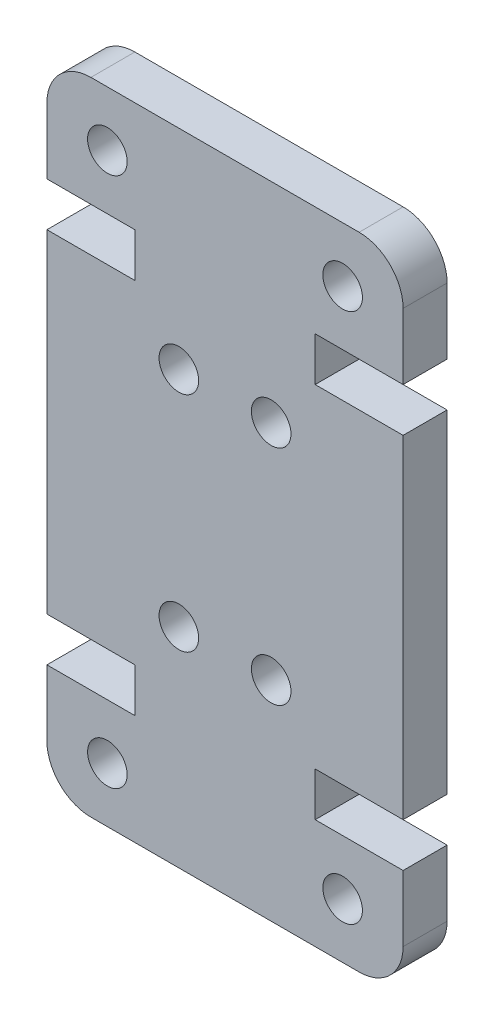
ISO-10303-21;
HEADER;
FILE_DESCRIPTION(('STEP AP214'),'2;1');
FILE_NAME('part.step','',(''),(''),'','','');
FILE_SCHEMA(('AUTOMOTIVE_DESIGN { 1 0 10303 214 1 1 1 1 }'));
ENDSEC;
DATA;
#1=APPLICATION_CONTEXT('core data for automotive mechanical design processes');
#2=APPLICATION_PROTOCOL_DEFINITION('international standard','automotive_design',2000,#1);
#3=PRODUCT_CONTEXT('',#1,'mechanical');
#4=PRODUCT('Part','Part','',(#3));
#5=PRODUCT_RELATED_PRODUCT_CATEGORY('part','',(#4));
#6=PRODUCT_DEFINITION_FORMATION('','',#4);
#7=PRODUCT_DEFINITION_CONTEXT('part definition',#1,'design');
#8=PRODUCT_DEFINITION('design','',#6,#7);
#9=PRODUCT_DEFINITION_SHAPE('','',#8);
#10=(LENGTH_UNIT() NAMED_UNIT(*) SI_UNIT(.MILLI.,.METRE.));
#11=(NAMED_UNIT(*) PLANE_ANGLE_UNIT() SI_UNIT($,.RADIAN.));
#12=(NAMED_UNIT(*) SI_UNIT($,.STERADIAN.) SOLID_ANGLE_UNIT());
#13=UNCERTAINTY_MEASURE_WITH_UNIT(LENGTH_MEASURE(1.E-05),#10,'distance_accuracy_value','');
#14=(GEOMETRIC_REPRESENTATION_CONTEXT(3) GLOBAL_UNCERTAINTY_ASSIGNED_CONTEXT((#13)) GLOBAL_UNIT_ASSIGNED_CONTEXT((#10,
#11,#12)) REPRESENTATION_CONTEXT('',''));
#15=CARTESIAN_POINT('',(0.,0.,0.));
#16=DIRECTION('',(0.,0.,1.));
#17=DIRECTION('',(1.,0.,0.));
#18=AXIS2_PLACEMENT_3D('',#15,#16,#17);
#19=CARTESIAN_POINT('',(2.00000000000002,2.,2.));
#20=DIRECTION('',(0.,0.,1.));
#21=DIRECTION('',(1.,0.,0.));
#22=AXIS2_PLACEMENT_3D('',#19,#20,#21);
#23=PLANE('',#22);
#24=CARTESIAN_POINT('',(10.2,19.6400000000004,2.));
#25=DIRECTION('',(0.,0.,1.));
#26=DIRECTION('',(1.,0.,0.));
#27=AXIS2_PLACEMENT_3D('',#24,#25,#26);
#28=CIRCLE('',#27,0.900000000000001);
#29=CARTESIAN_POINT('',(11.1,19.6400000000004,2.));
#30=VERTEX_POINT('',#29);
#31=EDGE_CURVE('E464',#30,#30,#28,.T.);
#32=ORIENTED_EDGE('',*,*,#31,.F.);
#33=EDGE_LOOP('',(#32));
#34=FACE_BOUND('',#33,.T.);
#35=CARTESIAN_POINT('',(6.,19.6400000000004,2.));
#36=DIRECTION('',(0.,0.,1.));
#37=DIRECTION('',(-1.,0.,0.));
#38=AXIS2_PLACEMENT_3D('',#35,#36,#37);
#39=CIRCLE('',#38,0.9);
#40=CARTESIAN_POINT('',(5.1,19.6400000000004,2.));
#41=VERTEX_POINT('',#40);
#42=EDGE_CURVE('E476',#41,#41,#39,.T.);
#43=ORIENTED_EDGE('',*,*,#42,.F.);
#44=EDGE_LOOP('',(#43));
#45=FACE_BOUND('',#44,.T.);
#46=CARTESIAN_POINT('',(2.75000000000004,26.6399999999998,2.));
#47=DIRECTION('',(0.,0.,1.));
#48=DIRECTION('',(-1.,0.,0.));
#49=AXIS2_PLACEMENT_3D('',#46,#47,#48);
#50=CIRCLE('',#49,0.9);
#51=CARTESIAN_POINT('',(1.85000000000004,26.6399999999998,2.));
#52=VERTEX_POINT('',#51);
#53=EDGE_CURVE('E488',#52,#52,#50,.T.);
#54=ORIENTED_EDGE('',*,*,#53,.F.);
#55=EDGE_LOOP('',(#54));
#56=FACE_BOUND('',#55,.T.);
#57=CARTESIAN_POINT('',(13.45,2.50000000000017,2.));
#58=DIRECTION('',(0.,0.,1.));
#59=DIRECTION('',(-1.,0.,0.));
#60=AXIS2_PLACEMENT_3D('',#57,#58,#59);
#61=CIRCLE('',#60,0.9);
#62=CARTESIAN_POINT('',(12.55,2.50000000000017,2.));
#63=VERTEX_POINT('',#62);
#64=EDGE_CURVE('E230',#63,#63,#61,.T.);
#65=ORIENTED_EDGE('',*,*,#64,.F.);
#66=EDGE_LOOP('',(#65));
#67=FACE_BOUND('',#66,.T.);
#68=DIRECTION('',(1.,0.,0.));
#69=VECTOR('',#68,1.);
#70=CARTESIAN_POINT('',(0.,6.99999999999946,2.));
#71=LINE('',#70,#69);
#72=CARTESIAN_POINT('',(0.,6.99999999999946,2.));
#73=VERTEX_POINT('',#72);
#74=CARTESIAN_POINT('',(4.00000000000002,6.99999999999946,2.));
#75=VERTEX_POINT('',#74);
#76=EDGE_CURVE('E273',#73,#75,#71,.T.);
#77=ORIENTED_EDGE('',*,*,#76,.T.);
#78=DIRECTION('',(0.,-1.,0.));
#79=VECTOR('',#78,1.);
#80=CARTESIAN_POINT('',(4.00000000000002,6.99999999999946,2.));
#81=LINE('',#80,#79);
#82=CARTESIAN_POINT('',(4.,4.99999999999945,2.));
#83=VERTEX_POINT('',#82);
#84=EDGE_CURVE('E141',#75,#83,#81,.T.);
#85=ORIENTED_EDGE('',*,*,#84,.T.);
#86=DIRECTION('',(-1.,0.,0.));
#87=VECTOR('',#86,1.);
#88=CARTESIAN_POINT('',(4.,4.99999999999945,2.));
#89=LINE('',#88,#87);
#90=CARTESIAN_POINT('',(0.,4.99999999999945,2.));
#91=VERTEX_POINT('',#90);
#92=EDGE_CURVE('E336',#83,#91,#89,.T.);
#93=ORIENTED_EDGE('',*,*,#92,.T.);
#94=DIRECTION('',(0.,-1.,0.));
#95=VECTOR('',#94,1.);
#96=CARTESIAN_POINT('',(0.,2.,2.));
#97=LINE('',#96,#95);
#98=CARTESIAN_POINT('',(0.,2.,2.));
#99=VERTEX_POINT('',#98);
#100=EDGE_CURVE('E355',#91,#99,#97,.T.);
#101=ORIENTED_EDGE('',*,*,#100,.T.);
#102=CARTESIAN_POINT('',(2.00000000000002,2.,2.));
#103=DIRECTION('',(0.,0.,1.));
#104=DIRECTION('',(1.,0.,0.));
#105=AXIS2_PLACEMENT_3D('',#102,#103,#104);
#106=CIRCLE('',#105,2.00000000000001);
#107=CARTESIAN_POINT('',(2.00000000000002,0.,2.));
#108=VERTEX_POINT('',#107);
#109=EDGE_CURVE('E352',#99,#108,#106,.T.);
#110=ORIENTED_EDGE('',*,*,#109,.T.);
#111=DIRECTION('',(1.,0.,0.));
#112=VECTOR('',#111,1.);
#113=CARTESIAN_POINT('',(2.00000000000002,0.,2.));
#114=LINE('',#113,#112);
#115=CARTESIAN_POINT('',(14.2,0.,2.));
#116=VERTEX_POINT('',#115);
#117=EDGE_CURVE('E354',#108,#116,#114,.T.);
#118=ORIENTED_EDGE('',*,*,#117,.T.);
#119=CARTESIAN_POINT('',(14.2,2.,2.));
#120=DIRECTION('',(0.,0.,1.));
#121=DIRECTION('',(-1.,0.,0.));
#122=AXIS2_PLACEMENT_3D('',#119,#120,#121);
#123=CIRCLE('',#122,2.);
#124=CARTESIAN_POINT('',(16.2,2.,2.));
#125=VERTEX_POINT('',#124);
#126=EDGE_CURVE('E357',#116,#125,#123,.T.);
#127=ORIENTED_EDGE('',*,*,#126,.T.);
#128=DIRECTION('',(0.,1.,0.));
#129=VECTOR('',#128,1.);
#130=CARTESIAN_POINT('',(16.2,2.,2.));
#131=LINE('',#130,#129);
#132=CARTESIAN_POINT('',(16.2,4.99999999999945,2.));
#133=VERTEX_POINT('',#132);
#134=EDGE_CURVE('E363',#125,#133,#131,.T.);
#135=ORIENTED_EDGE('',*,*,#134,.T.);
#136=DIRECTION('',(-1.,0.,0.));
#137=VECTOR('',#136,1.);
#138=CARTESIAN_POINT('',(12.2,4.99999999999945,2.));
#139=LINE('',#138,#137);
#140=CARTESIAN_POINT('',(12.2,4.99999999999945,2.));
#141=VERTEX_POINT('',#140);
#142=EDGE_CURVE('E365',#133,#141,#139,.T.);
#143=ORIENTED_EDGE('',*,*,#142,.T.);
#144=DIRECTION('',(0.,1.,0.));
#145=VECTOR('',#144,1.);
#146=CARTESIAN_POINT('',(12.2,6.99999999999945,2.));
#147=LINE('',#146,#145);
#148=CARTESIAN_POINT('',(12.2,6.99999999999945,2.));
#149=VERTEX_POINT('',#148);
#150=EDGE_CURVE('E367',#141,#149,#147,.T.);
#151=ORIENTED_EDGE('',*,*,#150,.T.);
#152=DIRECTION('',(1.,0.,0.));
#153=VECTOR('',#152,1.);
#154=CARTESIAN_POINT('',(16.2,6.99999999999945,2.));
#155=LINE('',#154,#153);
#156=CARTESIAN_POINT('',(16.2,6.99999999999945,2.));
#157=VERTEX_POINT('',#156);
#158=EDGE_CURVE('E369',#149,#157,#155,.T.);
#159=ORIENTED_EDGE('',*,*,#158,.T.);
#160=DIRECTION('',(0.,1.,0.));
#161=VECTOR('',#160,1.);
#162=CARTESIAN_POINT('',(16.2,22.1400000000005,2.));
#163=LINE('',#162,#161);
#164=CARTESIAN_POINT('',(16.2,22.1400000000005,2.));
#165=VERTEX_POINT('',#164);
#166=EDGE_CURVE('E371',#157,#165,#163,.T.);
#167=ORIENTED_EDGE('',*,*,#166,.T.);
#168=DIRECTION('',(-1.,0.,0.));
#169=VECTOR('',#168,1.);
#170=CARTESIAN_POINT('',(16.2,22.1400000000005,2.));
#171=LINE('',#170,#169);
#172=CARTESIAN_POINT('',(12.2,22.1400000000005,2.));
#173=VERTEX_POINT('',#172);
#174=EDGE_CURVE('E373',#165,#173,#171,.T.);
#175=ORIENTED_EDGE('',*,*,#174,.T.);
#176=DIRECTION('',(0.,1.,0.));
#177=VECTOR('',#176,1.);
#178=CARTESIAN_POINT('',(12.2,22.1400000000005,2.));
#179=LINE('',#178,#177);
#180=CARTESIAN_POINT('',(12.2,24.1400000000006,2.));
#181=VERTEX_POINT('',#180);
#182=EDGE_CURVE('E375',#173,#181,#179,.T.);
#183=ORIENTED_EDGE('',*,*,#182,.T.);
#184=DIRECTION('',(1.,0.,0.));
#185=VECTOR('',#184,1.);
#186=CARTESIAN_POINT('',(12.2,24.1400000000006,2.));
#187=LINE('',#186,#185);
#188=CARTESIAN_POINT('',(16.2,24.1400000000006,2.));
#189=VERTEX_POINT('',#188);
#190=EDGE_CURVE('E377',#181,#189,#187,.T.);
#191=ORIENTED_EDGE('',*,*,#190,.T.);
#192=DIRECTION('',(0.,1.,0.));
#193=VECTOR('',#192,1.);
#194=CARTESIAN_POINT('',(16.2,27.14,2.));
#195=LINE('',#194,#193);
#196=CARTESIAN_POINT('',(16.2,27.14,2.));
#197=VERTEX_POINT('',#196);
#198=EDGE_CURVE('E379',#189,#197,#195,.T.);
#199=ORIENTED_EDGE('',*,*,#198,.T.);
#200=CARTESIAN_POINT('',(14.2,27.14,2.));
#201=DIRECTION('',(0.,0.,1.));
#202=DIRECTION('',(1.,0.,0.));
#203=AXIS2_PLACEMENT_3D('',#200,#201,#202);
#204=CIRCLE('',#203,2.);
#205=CARTESIAN_POINT('',(14.2,29.14,2.));
#206=VERTEX_POINT('',#205);
#207=EDGE_CURVE('E381',#197,#206,#204,.T.);
#208=ORIENTED_EDGE('',*,*,#207,.T.);
#209=DIRECTION('',(-1.,0.,0.));
#210=VECTOR('',#209,1.);
#211=CARTESIAN_POINT('',(1.99999999999999,29.14,2.));
#212=LINE('',#211,#210);
#213=CARTESIAN_POINT('',(1.99999999999999,29.14,2.));
#214=VERTEX_POINT('',#213);
#215=EDGE_CURVE('E383',#206,#214,#212,.T.);
#216=ORIENTED_EDGE('',*,*,#215,.T.);
#217=CARTESIAN_POINT('',(2.,27.14,2.));
#218=DIRECTION('',(0.,0.,1.));
#219=DIRECTION('',(-1.,0.,0.));
#220=AXIS2_PLACEMENT_3D('',#217,#218,#219);
#221=CIRCLE('',#220,2.);
#222=CARTESIAN_POINT('',(0.,27.14,2.));
#223=VERTEX_POINT('',#222);
#224=EDGE_CURVE('E385',#214,#223,#221,.T.);
#225=ORIENTED_EDGE('',*,*,#224,.T.);
#226=DIRECTION('',(0.,-1.,0.));
#227=VECTOR('',#226,1.);
#228=CARTESIAN_POINT('',(0.,27.14,2.));
#229=LINE('',#228,#227);
#230=CARTESIAN_POINT('',(0.,24.1400000000005,2.));
#231=VERTEX_POINT('',#230);
#232=EDGE_CURVE('E387',#223,#231,#229,.T.);
#233=ORIENTED_EDGE('',*,*,#232,.T.);
#234=DIRECTION('',(1.,0.,0.));
#235=VECTOR('',#234,1.);
#236=CARTESIAN_POINT('',(3.99999999999999,24.1400000000006,2.));
#237=LINE('',#236,#235);
#238=CARTESIAN_POINT('',(3.99999999999999,24.1400000000006,2.));
#239=VERTEX_POINT('',#238);
#240=EDGE_CURVE('E208',#231,#239,#237,.T.);
#241=ORIENTED_EDGE('',*,*,#240,.T.);
#242=DIRECTION('',(0.,-1.,0.));
#243=VECTOR('',#242,1.);
#244=CARTESIAN_POINT('',(4.,22.1400000000005,2.));
#245=LINE('',#244,#243);
#246=CARTESIAN_POINT('',(4.,22.1400000000005,2.));
#247=VERTEX_POINT('',#246);
#248=EDGE_CURVE('E202',#239,#247,#245,.T.);
#249=ORIENTED_EDGE('',*,*,#248,.T.);
#250=DIRECTION('',(-1.,0.,0.));
#251=VECTOR('',#250,1.);
#252=CARTESIAN_POINT('',(0.,22.1400000000005,2.));
#253=LINE('',#252,#251);
#254=CARTESIAN_POINT('',(0.,22.1400000000005,2.));
#255=VERTEX_POINT('',#254);
#256=EDGE_CURVE('E206',#247,#255,#253,.T.);
#257=ORIENTED_EDGE('',*,*,#256,.T.);
#258=DIRECTION('',(0.,-1.,0.));
#259=VECTOR('',#258,1.);
#260=CARTESIAN_POINT('',(0.,22.1400000000005,2.));
#261=LINE('',#260,#259);
#262=EDGE_CURVE('E50',#255,#73,#261,.T.);
#263=ORIENTED_EDGE('',*,*,#262,.T.);
#264=EDGE_LOOP('',(#77,#85,#93,#101,#110,#118,#127,#135,#143,#151,#159,#167,#175,#183,#191,#199,
#208,#216,#225,#233,#241,#249,#257,#263));
#265=FACE_BOUND('',#264,.T.);
#266=CARTESIAN_POINT('',(10.2,9.49999999999962,2.));
#267=DIRECTION('',(0.,0.,1.));
#268=DIRECTION('',(-1.,0.,0.));
#269=AXIS2_PLACEMENT_3D('',#266,#267,#268);
#270=CIRCLE('',#269,0.9);
#271=CARTESIAN_POINT('',(9.29999999999999,9.49999999999962,2.));
#272=VERTEX_POINT('',#271);
#273=EDGE_CURVE('E494',#272,#272,#270,.T.);
#274=ORIENTED_EDGE('',*,*,#273,.F.);
#275=EDGE_LOOP('',(#274));
#276=FACE_BOUND('',#275,.T.);
#277=CARTESIAN_POINT('',(6.00000000000001,9.49999999999962,2.));
#278=DIRECTION('',(0.,0.,1.));
#279=DIRECTION('',(1.,0.,0.));
#280=AXIS2_PLACEMENT_3D('',#277,#278,#279);
#281=CIRCLE('',#280,0.899999999999999);
#282=CARTESIAN_POINT('',(6.9,9.49999999999962,2.));
#283=VERTEX_POINT('',#282);
#284=EDGE_CURVE('E482',#283,#283,#281,.T.);
#285=ORIENTED_EDGE('',*,*,#284,.F.);
#286=EDGE_LOOP('',(#285));
#287=FACE_BOUND('',#286,.T.);
#288=CARTESIAN_POINT('',(2.75000000000004,2.50000000000017,2.));
#289=DIRECTION('',(0.,0.,1.));
#290=DIRECTION('',(1.,0.,0.));
#291=AXIS2_PLACEMENT_3D('',#288,#289,#290);
#292=CIRCLE('',#291,0.9);
#293=CARTESIAN_POINT('',(3.65000000000004,2.50000000000017,2.));
#294=VERTEX_POINT('',#293);
#295=EDGE_CURVE('E470',#294,#294,#292,.T.);
#296=ORIENTED_EDGE('',*,*,#295,.F.);
#297=EDGE_LOOP('',(#296));
#298=FACE_BOUND('',#297,.T.);
#299=CARTESIAN_POINT('',(13.45,26.6399999999998,2.));
#300=DIRECTION('',(0.,0.,1.));
#301=DIRECTION('',(1.,0.,0.));
#302=AXIS2_PLACEMENT_3D('',#299,#300,#301);
#303=CIRCLE('',#302,0.900000000000001);
#304=CARTESIAN_POINT('',(14.35,26.6399999999998,2.));
#305=VERTEX_POINT('',#304);
#306=EDGE_CURVE('E455',#305,#305,#303,.T.);
#307=ORIENTED_EDGE('',*,*,#306,.F.);
#308=EDGE_LOOP('',(#307));
#309=FACE_BOUND('',#308,.T.);
#310=ADVANCED_FACE('F33',(#34,#45,#56,#67,#265,#276,#287,#298,#309),#23,.T.);
#311=CARTESIAN_POINT('',(2.00000000000002,2.,0.));
#312=DIRECTION('',(0.,0.,1.));
#313=DIRECTION('',(1.,0.,0.));
#314=AXIS2_PLACEMENT_3D('',#311,#312,#313);
#315=PLANE('',#314);
#316=CARTESIAN_POINT('',(10.2,19.6400000000004,0.));
#317=DIRECTION('',(0.,0.,1.));
#318=DIRECTION('',(1.,0.,0.));
#319=AXIS2_PLACEMENT_3D('',#316,#317,#318);
#320=CIRCLE('',#319,0.900000000000001);
#321=CARTESIAN_POINT('',(11.1,19.6400000000004,0.));
#322=VERTEX_POINT('',#321);
#323=EDGE_CURVE('E461',#322,#322,#320,.T.);
#324=ORIENTED_EDGE('',*,*,#323,.T.);
#325=EDGE_LOOP('',(#324));
#326=FACE_BOUND('',#325,.T.);
#327=CARTESIAN_POINT('',(6.,19.6400000000004,0.));
#328=DIRECTION('',(0.,0.,1.));
#329=DIRECTION('',(-1.,0.,0.));
#330=AXIS2_PLACEMENT_3D('',#327,#328,#329);
#331=CIRCLE('',#330,0.9);
#332=CARTESIAN_POINT('',(5.1,19.6400000000004,0.));
#333=VERTEX_POINT('',#332);
#334=EDGE_CURVE('E473',#333,#333,#331,.T.);
#335=ORIENTED_EDGE('',*,*,#334,.T.);
#336=EDGE_LOOP('',(#335));
#337=FACE_BOUND('',#336,.T.);
#338=CARTESIAN_POINT('',(2.75000000000004,26.6399999999998,0.));
#339=DIRECTION('',(0.,0.,1.));
#340=DIRECTION('',(-1.,0.,0.));
#341=AXIS2_PLACEMENT_3D('',#338,#339,#340);
#342=CIRCLE('',#341,0.9);
#343=CARTESIAN_POINT('',(1.85000000000004,26.6399999999998,0.));
#344=VERTEX_POINT('',#343);
#345=EDGE_CURVE('E485',#344,#344,#342,.T.);
#346=ORIENTED_EDGE('',*,*,#345,.T.);
#347=EDGE_LOOP('',(#346));
#348=FACE_BOUND('',#347,.T.);
#349=CARTESIAN_POINT('',(13.45,2.50000000000017,0.));
#350=DIRECTION('',(0.,0.,1.));
#351=DIRECTION('',(-1.,0.,0.));
#352=AXIS2_PLACEMENT_3D('',#349,#350,#351);
#353=CIRCLE('',#352,0.9);
#354=CARTESIAN_POINT('',(12.55,2.50000000000017,0.));
#355=VERTEX_POINT('',#354);
#356=EDGE_CURVE('E497',#355,#355,#353,.T.);
#357=ORIENTED_EDGE('',*,*,#356,.T.);
#358=EDGE_LOOP('',(#357));
#359=FACE_BOUND('',#358,.T.);
#360=DIRECTION('',(1.,0.,0.));
#361=VECTOR('',#360,1.);
#362=CARTESIAN_POINT('',(0.,6.99999999999946,0.));
#363=LINE('',#362,#361);
#364=CARTESIAN_POINT('',(0.,6.99999999999946,0.));
#365=VERTEX_POINT('',#364);
#366=CARTESIAN_POINT('',(4.00000000000002,6.99999999999946,0.));
#367=VERTEX_POINT('',#366);
#368=EDGE_CURVE('E226',#365,#367,#363,.T.);
#369=ORIENTED_EDGE('',*,*,#368,.F.);
#370=DIRECTION('',(0.,-1.,0.));
#371=VECTOR('',#370,1.);
#372=CARTESIAN_POINT('',(0.,22.1400000000005,0.));
#373=LINE('',#372,#371);
#374=CARTESIAN_POINT('',(0.,22.1400000000005,0.));
#375=VERTEX_POINT('',#374);
#376=EDGE_CURVE('E133',#375,#365,#373,.T.);
#377=ORIENTED_EDGE('',*,*,#376,.F.);
#378=DIRECTION('',(-1.,0.,0.));
#379=VECTOR('',#378,1.);
#380=CARTESIAN_POINT('',(0.,22.1400000000005,0.));
#381=LINE('',#380,#379);
#382=CARTESIAN_POINT('',(4.,22.1400000000005,0.));
#383=VERTEX_POINT('',#382);
#384=EDGE_CURVE('E127',#383,#375,#381,.T.);
#385=ORIENTED_EDGE('',*,*,#384,.F.);
#386=DIRECTION('',(0.,-1.,0.));
#387=VECTOR('',#386,1.);
#388=CARTESIAN_POINT('',(4.,22.1400000000005,0.));
#389=LINE('',#388,#387);
#390=CARTESIAN_POINT('',(3.99999999999999,24.1400000000006,0.));
#391=VERTEX_POINT('',#390);
#392=EDGE_CURVE('E216',#391,#383,#389,.T.);
#393=ORIENTED_EDGE('',*,*,#392,.F.);
#394=DIRECTION('',(1.,0.,0.));
#395=VECTOR('',#394,1.);
#396=CARTESIAN_POINT('',(3.99999999999999,24.1400000000006,0.));
#397=LINE('',#396,#395);
#398=CARTESIAN_POINT('',(0.,24.1400000000005,0.));
#399=VERTEX_POINT('',#398);
#400=EDGE_CURVE('E268',#399,#391,#397,.T.);
#401=ORIENTED_EDGE('',*,*,#400,.F.);
#402=DIRECTION('',(0.,-1.,0.));
#403=VECTOR('',#402,1.);
#404=CARTESIAN_POINT('',(0.,27.14,0.));
#405=LINE('',#404,#403);
#406=CARTESIAN_POINT('',(0.,27.14,0.));
#407=VERTEX_POINT('',#406);
#408=EDGE_CURVE('E266',#407,#399,#405,.T.);
#409=ORIENTED_EDGE('',*,*,#408,.F.);
#410=CARTESIAN_POINT('',(2.,27.14,0.));
#411=DIRECTION('',(0.,0.,1.));
#412=DIRECTION('',(-1.,0.,0.));
#413=AXIS2_PLACEMENT_3D('',#410,#411,#412);
#414=CIRCLE('',#413,2.);
#415=CARTESIAN_POINT('',(1.99999999999999,29.14,0.));
#416=VERTEX_POINT('',#415);
#417=EDGE_CURVE('E264',#416,#407,#414,.T.);
#418=ORIENTED_EDGE('',*,*,#417,.F.);
#419=DIRECTION('',(-1.,0.,0.));
#420=VECTOR('',#419,1.);
#421=CARTESIAN_POINT('',(1.99999999999999,29.14,0.));
#422=LINE('',#421,#420);
#423=CARTESIAN_POINT('',(14.2,29.14,0.));
#424=VERTEX_POINT('',#423);
#425=EDGE_CURVE('E262',#424,#416,#422,.T.);
#426=ORIENTED_EDGE('',*,*,#425,.F.);
#427=CARTESIAN_POINT('',(14.2,27.14,0.));
#428=DIRECTION('',(0.,0.,1.));
#429=DIRECTION('',(1.,0.,0.));
#430=AXIS2_PLACEMENT_3D('',#427,#428,#429);
#431=CIRCLE('',#430,2.);
#432=CARTESIAN_POINT('',(16.2,27.14,0.));
#433=VERTEX_POINT('',#432);
#434=EDGE_CURVE('E260',#433,#424,#431,.T.);
#435=ORIENTED_EDGE('',*,*,#434,.F.);
#436=DIRECTION('',(0.,1.,0.));
#437=VECTOR('',#436,1.);
#438=CARTESIAN_POINT('',(16.2,27.14,0.));
#439=LINE('',#438,#437);
#440=CARTESIAN_POINT('',(16.2,24.1400000000006,0.));
#441=VERTEX_POINT('',#440);
#442=EDGE_CURVE('E258',#441,#433,#439,.T.);
#443=ORIENTED_EDGE('',*,*,#442,.F.);
#444=DIRECTION('',(1.,0.,0.));
#445=VECTOR('',#444,1.);
#446=CARTESIAN_POINT('',(12.2,24.1400000000006,0.));
#447=LINE('',#446,#445);
#448=CARTESIAN_POINT('',(12.2,24.1400000000006,0.));
#449=VERTEX_POINT('',#448);
#450=EDGE_CURVE('E256',#449,#441,#447,.T.);
#451=ORIENTED_EDGE('',*,*,#450,.F.);
#452=DIRECTION('',(0.,1.,0.));
#453=VECTOR('',#452,1.);
#454=CARTESIAN_POINT('',(12.2,22.1400000000005,0.));
#455=LINE('',#454,#453);
#456=CARTESIAN_POINT('',(12.2,22.1400000000005,0.));
#457=VERTEX_POINT('',#456);
#458=EDGE_CURVE('E254',#457,#449,#455,.T.);
#459=ORIENTED_EDGE('',*,*,#458,.F.);
#460=DIRECTION('',(-1.,0.,0.));
#461=VECTOR('',#460,1.);
#462=CARTESIAN_POINT('',(16.2,22.1400000000005,0.));
#463=LINE('',#462,#461);
#464=CARTESIAN_POINT('',(16.2,22.1400000000005,0.));
#465=VERTEX_POINT('',#464);
#466=EDGE_CURVE('E252',#465,#457,#463,.T.);
#467=ORIENTED_EDGE('',*,*,#466,.F.);
#468=DIRECTION('',(0.,1.,0.));
#469=VECTOR('',#468,1.);
#470=CARTESIAN_POINT('',(16.2,22.1400000000005,0.));
#471=LINE('',#470,#469);
#472=CARTESIAN_POINT('',(16.2,6.99999999999945,0.));
#473=VERTEX_POINT('',#472);
#474=EDGE_CURVE('E250',#473,#465,#471,.T.);
#475=ORIENTED_EDGE('',*,*,#474,.F.);
#476=DIRECTION('',(1.,0.,0.));
#477=VECTOR('',#476,1.);
#478=CARTESIAN_POINT('',(16.2,6.99999999999945,0.));
#479=LINE('',#478,#477);
#480=CARTESIAN_POINT('',(12.2,6.99999999999945,0.));
#481=VERTEX_POINT('',#480);
#482=EDGE_CURVE('E248',#481,#473,#479,.T.);
#483=ORIENTED_EDGE('',*,*,#482,.F.);
#484=DIRECTION('',(0.,1.,0.));
#485=VECTOR('',#484,1.);
#486=CARTESIAN_POINT('',(12.2,6.99999999999945,0.));
#487=LINE('',#486,#485);
#488=CARTESIAN_POINT('',(12.2,4.99999999999945,0.));
#489=VERTEX_POINT('',#488);
#490=EDGE_CURVE('E246',#489,#481,#487,.T.);
#491=ORIENTED_EDGE('',*,*,#490,.F.);
#492=DIRECTION('',(-1.,0.,0.));
#493=VECTOR('',#492,1.);
#494=CARTESIAN_POINT('',(12.2,4.99999999999945,0.));
#495=LINE('',#494,#493);
#496=CARTESIAN_POINT('',(16.2,4.99999999999945,0.));
#497=VERTEX_POINT('',#496);
#498=EDGE_CURVE('E244',#497,#489,#495,.T.);
#499=ORIENTED_EDGE('',*,*,#498,.F.);
#500=DIRECTION('',(0.,1.,0.));
#501=VECTOR('',#500,1.);
#502=CARTESIAN_POINT('',(16.2,2.,0.));
#503=LINE('',#502,#501);
#504=CARTESIAN_POINT('',(16.2,2.,0.));
#505=VERTEX_POINT('',#504);
#506=EDGE_CURVE('E242',#505,#497,#503,.T.);
#507=ORIENTED_EDGE('',*,*,#506,.F.);
#508=CARTESIAN_POINT('',(14.2,2.,0.));
#509=DIRECTION('',(0.,0.,1.));
#510=DIRECTION('',(-1.,0.,0.));
#511=AXIS2_PLACEMENT_3D('',#508,#509,#510);
#512=CIRCLE('',#511,2.);
#513=CARTESIAN_POINT('',(14.2,0.,0.));
#514=VERTEX_POINT('',#513);
#515=EDGE_CURVE('E240',#514,#505,#512,.T.);
#516=ORIENTED_EDGE('',*,*,#515,.F.);
#517=DIRECTION('',(1.,0.,0.));
#518=VECTOR('',#517,1.);
#519=CARTESIAN_POINT('',(2.00000000000002,0.,0.));
#520=LINE('',#519,#518);
#521=CARTESIAN_POINT('',(2.00000000000002,0.,0.));
#522=VERTEX_POINT('',#521);
#523=EDGE_CURVE('E238',#522,#514,#520,.T.);
#524=ORIENTED_EDGE('',*,*,#523,.F.);
#525=CARTESIAN_POINT('',(2.00000000000002,2.,0.));
#526=DIRECTION('',(0.,0.,1.));
#527=DIRECTION('',(1.,0.,0.));
#528=AXIS2_PLACEMENT_3D('',#525,#526,#527);
#529=CIRCLE('',#528,2.00000000000001);
#530=CARTESIAN_POINT('',(0.,2.,0.));
#531=VERTEX_POINT('',#530);
#532=EDGE_CURVE('E236',#531,#522,#529,.T.);
#533=ORIENTED_EDGE('',*,*,#532,.F.);
#534=DIRECTION('',(0.,-1.,0.));
#535=VECTOR('',#534,1.);
#536=CARTESIAN_POINT('',(0.,2.,0.));
#537=LINE('',#536,#535);
#538=CARTESIAN_POINT('',(0.,4.99999999999945,0.));
#539=VERTEX_POINT('',#538);
#540=EDGE_CURVE('E234',#539,#531,#537,.T.);
#541=ORIENTED_EDGE('',*,*,#540,.F.);
#542=DIRECTION('',(-1.,0.,0.));
#543=VECTOR('',#542,1.);
#544=CARTESIAN_POINT('',(4.,4.99999999999945,0.));
#545=LINE('',#544,#543);
#546=CARTESIAN_POINT('',(4.,4.99999999999945,0.));
#547=VERTEX_POINT('',#546);
#548=EDGE_CURVE('E232',#547,#539,#545,.T.);
#549=ORIENTED_EDGE('',*,*,#548,.F.);
#550=DIRECTION('',(0.,-1.,0.));
#551=VECTOR('',#550,1.);
#552=CARTESIAN_POINT('',(4.00000000000002,6.99999999999946,0.));
#553=LINE('',#552,#551);
#554=EDGE_CURVE('E229',#367,#547,#553,.T.);
#555=ORIENTED_EDGE('',*,*,#554,.F.);
#556=EDGE_LOOP('',(#369,#377,#385,#393,#401,#409,#418,#426,#435,#443,#451,#459,#467,#475,#483,
#491,#499,#507,#516,#524,#533,#541,#549,#555));
#557=FACE_BOUND('',#556,.T.);
#558=CARTESIAN_POINT('',(10.2,9.49999999999962,0.));
#559=DIRECTION('',(0.,0.,1.));
#560=DIRECTION('',(-1.,0.,0.));
#561=AXIS2_PLACEMENT_3D('',#558,#559,#560);
#562=CIRCLE('',#561,0.9);
#563=CARTESIAN_POINT('',(9.29999999999999,9.49999999999962,0.));
#564=VERTEX_POINT('',#563);
#565=EDGE_CURVE('E491',#564,#564,#562,.T.);
#566=ORIENTED_EDGE('',*,*,#565,.T.);
#567=EDGE_LOOP('',(#566));
#568=FACE_BOUND('',#567,.T.);
#569=CARTESIAN_POINT('',(6.00000000000001,9.49999999999962,0.));
#570=DIRECTION('',(0.,0.,1.));
#571=DIRECTION('',(1.,0.,0.));
#572=AXIS2_PLACEMENT_3D('',#569,#570,#571);
#573=CIRCLE('',#572,0.899999999999999);
#574=CARTESIAN_POINT('',(6.9,9.49999999999962,0.));
#575=VERTEX_POINT('',#574);
#576=EDGE_CURVE('E479',#575,#575,#573,.T.);
#577=ORIENTED_EDGE('',*,*,#576,.T.);
#578=EDGE_LOOP('',(#577));
#579=FACE_BOUND('',#578,.T.);
#580=CARTESIAN_POINT('',(2.75000000000004,2.50000000000017,0.));
#581=DIRECTION('',(0.,0.,1.));
#582=DIRECTION('',(1.,0.,0.));
#583=AXIS2_PLACEMENT_3D('',#580,#581,#582);
#584=CIRCLE('',#583,0.9);
#585=CARTESIAN_POINT('',(3.65000000000004,2.50000000000017,0.));
#586=VERTEX_POINT('',#585);
#587=EDGE_CURVE('E467',#586,#586,#584,.T.);
#588=ORIENTED_EDGE('',*,*,#587,.T.);
#589=EDGE_LOOP('',(#588));
#590=FACE_BOUND('',#589,.T.);
#591=CARTESIAN_POINT('',(13.45,26.6399999999998,0.));
#592=DIRECTION('',(0.,0.,1.));
#593=DIRECTION('',(1.,0.,0.));
#594=AXIS2_PLACEMENT_3D('',#591,#592,#593);
#595=CIRCLE('',#594,0.900000000000001);
#596=CARTESIAN_POINT('',(14.35,26.6399999999998,0.));
#597=VERTEX_POINT('',#596);
#598=EDGE_CURVE('E458',#597,#597,#595,.T.);
#599=ORIENTED_EDGE('',*,*,#598,.T.);
#600=EDGE_LOOP('',(#599));
#601=FACE_BOUND('',#600,.T.);
#602=ADVANCED_FACE('F340',(#326,#337,#348,#359,#557,#568,#579,#590,#601),#315,.F.);
#603=CARTESIAN_POINT('',(0.,6.99999999999946,2.));
#604=DIRECTION('',(0.,1.,0.));
#605=DIRECTION('',(0.,0.,1.));
#606=AXIS2_PLACEMENT_3D('',#603,#604,#605);
#607=PLANE('',#606);
#608=ORIENTED_EDGE('',*,*,#368,.T.);
#609=DIRECTION('',(0.,0.,-1.));
#610=VECTOR('',#609,1.);
#611=CARTESIAN_POINT('',(4.00000000000002,6.99999999999946,2.));
#612=LINE('',#611,#610);
#613=EDGE_CURVE('E11',#75,#367,#612,.T.);
#614=ORIENTED_EDGE('',*,*,#613,.F.);
#615=ORIENTED_EDGE('',*,*,#76,.F.);
#616=DIRECTION('',(0.,0.,-1.));
#617=VECTOR('',#616,1.);
#618=CARTESIAN_POINT('',(0.,6.99999999999946,2.));
#619=LINE('',#618,#617);
#620=EDGE_CURVE('E222',#73,#365,#619,.T.);
#621=ORIENTED_EDGE('',*,*,#620,.T.);
#622=EDGE_LOOP('',(#608,#614,#615,#621));
#623=FACE_BOUND('',#622,.T.);
#624=ADVANCED_FACE('F35',(#623),#607,.F.);
#625=CARTESIAN_POINT('',(4.00000000000002,6.99999999999946,2.));
#626=DIRECTION('',(1.,0.,0.));
#627=DIRECTION('',(0.,1.,0.));
#628=AXIS2_PLACEMENT_3D('',#625,#626,#627);
#629=PLANE('',#628);
#630=ORIENTED_EDGE('',*,*,#554,.T.);
#631=DIRECTION('',(0.,0.,-1.));
#632=VECTOR('',#631,1.);
#633=CARTESIAN_POINT('',(4.,4.99999999999945,2.));
#634=LINE('',#633,#632);
#635=EDGE_CURVE('E42',#83,#547,#634,.T.);
#636=ORIENTED_EDGE('',*,*,#635,.F.);
#637=ORIENTED_EDGE('',*,*,#84,.F.);
#638=ORIENTED_EDGE('',*,*,#613,.T.);
#639=EDGE_LOOP('',(#630,#636,#637,#638));
#640=FACE_BOUND('',#639,.T.);
#641=ADVANCED_FACE('F762',(#640),#629,.F.);
#642=CARTESIAN_POINT('',(4.,4.99999999999945,2.));
#643=DIRECTION('',(0.,-1.,0.));
#644=DIRECTION('',(0.,0.,-1.));
#645=AXIS2_PLACEMENT_3D('',#642,#643,#644);
#646=PLANE('',#645);
#647=ORIENTED_EDGE('',*,*,#548,.T.);
#648=DIRECTION('',(0.,0.,-1.));
#649=VECTOR('',#648,1.);
#650=CARTESIAN_POINT('',(0.,4.99999999999945,2.));
#651=LINE('',#650,#649);
#652=EDGE_CURVE('E328',#91,#539,#651,.T.);
#653=ORIENTED_EDGE('',*,*,#652,.F.);
#654=ORIENTED_EDGE('',*,*,#92,.F.);
#655=ORIENTED_EDGE('',*,*,#635,.T.);
#656=EDGE_LOOP('',(#647,#653,#654,#655));
#657=FACE_BOUND('',#656,.T.);
#658=ADVANCED_FACE('F334',(#657),#646,.F.);
#659=CARTESIAN_POINT('',(0.,2.,2.));
#660=DIRECTION('',(1.,0.,0.));
#661=DIRECTION('',(0.,0.,-1.));
#662=AXIS2_PLACEMENT_3D('',#659,#660,#661);
#663=PLANE('',#662);
#664=ORIENTED_EDGE('',*,*,#540,.T.);
#665=DIRECTION('',(0.,0.,-1.));
#666=VECTOR('',#665,1.);
#667=CARTESIAN_POINT('',(0.,2.,2.));
#668=LINE('',#667,#666);
#669=EDGE_CURVE('E325',#99,#531,#668,.T.);
#670=ORIENTED_EDGE('',*,*,#669,.F.);
#671=ORIENTED_EDGE('',*,*,#100,.F.);
#672=ORIENTED_EDGE('',*,*,#652,.T.);
#673=EDGE_LOOP('',(#664,#670,#671,#672));
#674=FACE_BOUND('',#673,.T.);
#675=ADVANCED_FACE('F346',(#674),#663,.F.);
#676=CARTESIAN_POINT('',(2.00000000000002,2.,2.));
#677=DIRECTION('',(0.,0.,-1.));
#678=DIRECTION('',(-1.,0.,0.));
#679=AXIS2_PLACEMENT_3D('',#676,#677,#678);
#680=CYLINDRICAL_SURFACE('',#679,2.00000000000001);
#681=ORIENTED_EDGE('',*,*,#532,.T.);
#682=DIRECTION('',(0.,0.,-1.));
#683=VECTOR('',#682,1.);
#684=CARTESIAN_POINT('',(2.00000000000002,0.,2.));
#685=LINE('',#684,#683);
#686=EDGE_CURVE('E322',#108,#522,#685,.T.);
#687=ORIENTED_EDGE('',*,*,#686,.F.);
#688=ORIENTED_EDGE('',*,*,#109,.F.);
#689=ORIENTED_EDGE('',*,*,#669,.T.);
#690=EDGE_LOOP('',(#681,#687,#688,#689));
#691=FACE_BOUND('',#690,.T.);
#692=ADVANCED_FACE('F350',(#691),#680,.T.);
#693=CARTESIAN_POINT('',(2.00000000000002,0.,2.));
#694=DIRECTION('',(0.,1.,0.));
#695=DIRECTION('',(-1.,0.,0.));
#696=AXIS2_PLACEMENT_3D('',#693,#694,#695);
#697=PLANE('',#696);
#698=ORIENTED_EDGE('',*,*,#523,.T.);
#699=DIRECTION('',(0.,0.,-1.));
#700=VECTOR('',#699,1.);
#701=CARTESIAN_POINT('',(14.2,0.,2.));
#702=LINE('',#701,#700);
#703=EDGE_CURVE('E319',#116,#514,#702,.T.);
#704=ORIENTED_EDGE('',*,*,#703,.F.);
#705=ORIENTED_EDGE('',*,*,#117,.F.);
#706=ORIENTED_EDGE('',*,*,#686,.T.);
#707=EDGE_LOOP('',(#698,#704,#705,#706));
#708=FACE_BOUND('',#707,.T.);
#709=ADVANCED_FACE('F727',(#708),#697,.F.);
#710=CARTESIAN_POINT('',(14.2,2.,2.));
#711=DIRECTION('',(0.,0.,-1.));
#712=DIRECTION('',(-1.,0.,0.));
#713=AXIS2_PLACEMENT_3D('',#710,#711,#712);
#714=CYLINDRICAL_SURFACE('',#713,2.);
#715=ORIENTED_EDGE('',*,*,#515,.T.);
#716=DIRECTION('',(0.,0.,-1.));
#717=VECTOR('',#716,1.);
#718=CARTESIAN_POINT('',(16.2,2.,2.));
#719=LINE('',#718,#717);
#720=EDGE_CURVE('E316',#125,#505,#719,.T.);
#721=ORIENTED_EDGE('',*,*,#720,.F.);
#722=ORIENTED_EDGE('',*,*,#126,.F.);
#723=ORIENTED_EDGE('',*,*,#703,.T.);
#724=EDGE_LOOP('',(#715,#721,#722,#723));
#725=FACE_BOUND('',#724,.T.);
#726=ADVANCED_FACE('F717',(#725),#714,.T.);
#727=CARTESIAN_POINT('',(16.2,2.,2.));
#728=DIRECTION('',(-1.,0.,0.));
#729=DIRECTION('',(0.,0.,1.));
#730=AXIS2_PLACEMENT_3D('',#727,#728,#729);
#731=PLANE('',#730);
#732=ORIENTED_EDGE('',*,*,#506,.T.);
#733=DIRECTION('',(0.,0.,-1.));
#734=VECTOR('',#733,1.);
#735=CARTESIAN_POINT('',(16.2,4.99999999999945,2.));
#736=LINE('',#735,#734);
#737=EDGE_CURVE('E313',#133,#497,#736,.T.);
#738=ORIENTED_EDGE('',*,*,#737,.F.);
#739=ORIENTED_EDGE('',*,*,#134,.F.);
#740=ORIENTED_EDGE('',*,*,#720,.T.);
#741=EDGE_LOOP('',(#732,#738,#739,#740));
#742=FACE_BOUND('',#741,.T.);
#743=ADVANCED_FACE('F707',(#742),#731,.F.);
#744=CARTESIAN_POINT('',(12.2,4.99999999999945,2.));
#745=DIRECTION('',(0.,-1.,0.));
#746=DIRECTION('',(0.,0.,-1.));
#747=AXIS2_PLACEMENT_3D('',#744,#745,#746);
#748=PLANE('',#747);
#749=ORIENTED_EDGE('',*,*,#498,.T.);
#750=DIRECTION('',(0.,0.,-1.));
#751=VECTOR('',#750,1.);
#752=CARTESIAN_POINT('',(12.2,4.99999999999945,2.));
#753=LINE('',#752,#751);
#754=EDGE_CURVE('E310',#141,#489,#753,.T.);
#755=ORIENTED_EDGE('',*,*,#754,.F.);
#756=ORIENTED_EDGE('',*,*,#142,.F.);
#757=ORIENTED_EDGE('',*,*,#737,.T.);
#758=EDGE_LOOP('',(#749,#755,#756,#757));
#759=FACE_BOUND('',#758,.T.);
#760=ADVANCED_FACE('F697',(#759),#748,.F.);
#761=CARTESIAN_POINT('',(12.2,6.99999999999945,2.));
#762=DIRECTION('',(-1.,0.,0.));
#763=DIRECTION('',(0.,0.,1.));
#764=AXIS2_PLACEMENT_3D('',#761,#762,#763);
#765=PLANE('',#764);
#766=ORIENTED_EDGE('',*,*,#490,.T.);
#767=DIRECTION('',(0.,0.,-1.));
#768=VECTOR('',#767,1.);
#769=CARTESIAN_POINT('',(12.2,6.99999999999945,2.));
#770=LINE('',#769,#768);
#771=EDGE_CURVE('E307',#149,#481,#770,.T.);
#772=ORIENTED_EDGE('',*,*,#771,.F.);
#773=ORIENTED_EDGE('',*,*,#150,.F.);
#774=ORIENTED_EDGE('',*,*,#754,.T.);
#775=EDGE_LOOP('',(#766,#772,#773,#774));
#776=FACE_BOUND('',#775,.T.);
#777=ADVANCED_FACE('F687',(#776),#765,.F.);
#778=CARTESIAN_POINT('',(16.2,6.99999999999945,2.));
#779=DIRECTION('',(0.,1.,0.));
#780=DIRECTION('',(-1.,0.,0.));
#781=AXIS2_PLACEMENT_3D('',#778,#779,#780);
#782=PLANE('',#781);
#783=ORIENTED_EDGE('',*,*,#482,.T.);
#784=DIRECTION('',(0.,0.,-1.));
#785=VECTOR('',#784,1.);
#786=CARTESIAN_POINT('',(16.2,6.99999999999945,2.));
#787=LINE('',#786,#785);
#788=EDGE_CURVE('E304',#157,#473,#787,.T.);
#789=ORIENTED_EDGE('',*,*,#788,.F.);
#790=ORIENTED_EDGE('',*,*,#158,.F.);
#791=ORIENTED_EDGE('',*,*,#771,.T.);
#792=EDGE_LOOP('',(#783,#789,#790,#791));
#793=FACE_BOUND('',#792,.T.);
#794=ADVANCED_FACE('F677',(#793),#782,.F.);
#795=CARTESIAN_POINT('',(16.2,22.1400000000005,2.));
#796=DIRECTION('',(-1.,0.,0.));
#797=DIRECTION('',(0.,0.,1.));
#798=AXIS2_PLACEMENT_3D('',#795,#796,#797);
#799=PLANE('',#798);
#800=ORIENTED_EDGE('',*,*,#474,.T.);
#801=DIRECTION('',(0.,0.,-1.));
#802=VECTOR('',#801,1.);
#803=CARTESIAN_POINT('',(16.2,22.1400000000005,2.));
#804=LINE('',#803,#802);
#805=EDGE_CURVE('E301',#165,#465,#804,.T.);
#806=ORIENTED_EDGE('',*,*,#805,.F.);
#807=ORIENTED_EDGE('',*,*,#166,.F.);
#808=ORIENTED_EDGE('',*,*,#788,.T.);
#809=EDGE_LOOP('',(#800,#806,#807,#808));
#810=FACE_BOUND('',#809,.T.);
#811=ADVANCED_FACE('F667',(#810),#799,.F.);
#812=CARTESIAN_POINT('',(16.2,22.1400000000005,2.));
#813=DIRECTION('',(0.,-1.,0.));
#814=DIRECTION('',(0.,0.,-1.));
#815=AXIS2_PLACEMENT_3D('',#812,#813,#814);
#816=PLANE('',#815);
#817=ORIENTED_EDGE('',*,*,#466,.T.);
#818=DIRECTION('',(0.,0.,-1.));
#819=VECTOR('',#818,1.);
#820=CARTESIAN_POINT('',(12.2,22.1400000000005,2.));
#821=LINE('',#820,#819);
#822=EDGE_CURVE('E298',#173,#457,#821,.T.);
#823=ORIENTED_EDGE('',*,*,#822,.F.);
#824=ORIENTED_EDGE('',*,*,#174,.F.);
#825=ORIENTED_EDGE('',*,*,#805,.T.);
#826=EDGE_LOOP('',(#817,#823,#824,#825));
#827=FACE_BOUND('',#826,.T.);
#828=ADVANCED_FACE('F657',(#827),#816,.F.);
#829=CARTESIAN_POINT('',(12.2,22.1400000000005,2.));
#830=DIRECTION('',(-1.,0.,0.));
#831=DIRECTION('',(0.,0.,1.));
#832=AXIS2_PLACEMENT_3D('',#829,#830,#831);
#833=PLANE('',#832);
#834=ORIENTED_EDGE('',*,*,#458,.T.);
#835=DIRECTION('',(0.,0.,-1.));
#836=VECTOR('',#835,1.);
#837=CARTESIAN_POINT('',(12.2,24.1400000000006,2.));
#838=LINE('',#837,#836);
#839=EDGE_CURVE('E295',#181,#449,#838,.T.);
#840=ORIENTED_EDGE('',*,*,#839,.F.);
#841=ORIENTED_EDGE('',*,*,#182,.F.);
#842=ORIENTED_EDGE('',*,*,#822,.T.);
#843=EDGE_LOOP('',(#834,#840,#841,#842));
#844=FACE_BOUND('',#843,.T.);
#845=ADVANCED_FACE('F647',(#844),#833,.F.);
#846=CARTESIAN_POINT('',(12.2,24.1400000000006,2.));
#847=DIRECTION('',(0.,1.,0.));
#848=DIRECTION('',(0.,0.,1.));
#849=AXIS2_PLACEMENT_3D('',#846,#847,#848);
#850=PLANE('',#849);
#851=ORIENTED_EDGE('',*,*,#450,.T.);
#852=DIRECTION('',(0.,0.,-1.));
#853=VECTOR('',#852,1.);
#854=CARTESIAN_POINT('',(16.2,24.1400000000006,2.));
#855=LINE('',#854,#853);
#856=EDGE_CURVE('E292',#189,#441,#855,.T.);
#857=ORIENTED_EDGE('',*,*,#856,.F.);
#858=ORIENTED_EDGE('',*,*,#190,.F.);
#859=ORIENTED_EDGE('',*,*,#839,.T.);
#860=EDGE_LOOP('',(#851,#857,#858,#859));
#861=FACE_BOUND('',#860,.T.);
#862=ADVANCED_FACE('F637',(#861),#850,.F.);
#863=CARTESIAN_POINT('',(16.2,27.14,2.));
#864=DIRECTION('',(-1.,0.,0.));
#865=DIRECTION('',(0.,0.,1.));
#866=AXIS2_PLACEMENT_3D('',#863,#864,#865);
#867=PLANE('',#866);
#868=ORIENTED_EDGE('',*,*,#442,.T.);
#869=DIRECTION('',(0.,0.,-1.));
#870=VECTOR('',#869,1.);
#871=CARTESIAN_POINT('',(16.2,27.14,2.));
#872=LINE('',#871,#870);
#873=EDGE_CURVE('E289',#197,#433,#872,.T.);
#874=ORIENTED_EDGE('',*,*,#873,.F.);
#875=ORIENTED_EDGE('',*,*,#198,.F.);
#876=ORIENTED_EDGE('',*,*,#856,.T.);
#877=EDGE_LOOP('',(#868,#874,#875,#876));
#878=FACE_BOUND('',#877,.T.);
#879=ADVANCED_FACE('F627',(#878),#867,.F.);
#880=CARTESIAN_POINT('',(14.2,27.14,2.));
#881=DIRECTION('',(0.,0.,-1.));
#882=DIRECTION('',(-1.,0.,0.));
#883=AXIS2_PLACEMENT_3D('',#880,#881,#882);
#884=CYLINDRICAL_SURFACE('',#883,2.);
#885=ORIENTED_EDGE('',*,*,#434,.T.);
#886=DIRECTION('',(0.,0.,-1.));
#887=VECTOR('',#886,1.);
#888=CARTESIAN_POINT('',(14.2,29.14,2.));
#889=LINE('',#888,#887);
#890=EDGE_CURVE('E286',#206,#424,#889,.T.);
#891=ORIENTED_EDGE('',*,*,#890,.F.);
#892=ORIENTED_EDGE('',*,*,#207,.F.);
#893=ORIENTED_EDGE('',*,*,#873,.T.);
#894=EDGE_LOOP('',(#885,#891,#892,#893));
#895=FACE_BOUND('',#894,.T.);
#896=ADVANCED_FACE('F617',(#895),#884,.T.);
#897=CARTESIAN_POINT('',(1.99999999999999,29.14,2.));
#898=DIRECTION('',(0.,-1.,0.));
#899=DIRECTION('',(0.,0.,-1.));
#900=AXIS2_PLACEMENT_3D('',#897,#898,#899);
#901=PLANE('',#900);
#902=ORIENTED_EDGE('',*,*,#425,.T.);
#903=DIRECTION('',(0.,0.,-1.));
#904=VECTOR('',#903,1.);
#905=CARTESIAN_POINT('',(1.99999999999999,29.14,2.));
#906=LINE('',#905,#904);
#907=EDGE_CURVE('E283',#214,#416,#906,.T.);
#908=ORIENTED_EDGE('',*,*,#907,.F.);
#909=ORIENTED_EDGE('',*,*,#215,.F.);
#910=ORIENTED_EDGE('',*,*,#890,.T.);
#911=EDGE_LOOP('',(#902,#908,#909,#910));
#912=FACE_BOUND('',#911,.T.);
#913=ADVANCED_FACE('F607',(#912),#901,.F.);
#914=CARTESIAN_POINT('',(2.,27.14,2.));
#915=DIRECTION('',(0.,0.,-1.));
#916=DIRECTION('',(-1.,0.,0.));
#917=AXIS2_PLACEMENT_3D('',#914,#915,#916);
#918=CYLINDRICAL_SURFACE('',#917,2.);
#919=ORIENTED_EDGE('',*,*,#417,.T.);
#920=DIRECTION('',(0.,0.,-1.));
#921=VECTOR('',#920,1.);
#922=CARTESIAN_POINT('',(0.,27.14,2.));
#923=LINE('',#922,#921);
#924=EDGE_CURVE('E280',#223,#407,#923,.T.);
#925=ORIENTED_EDGE('',*,*,#924,.F.);
#926=ORIENTED_EDGE('',*,*,#224,.F.);
#927=ORIENTED_EDGE('',*,*,#907,.T.);
#928=EDGE_LOOP('',(#919,#925,#926,#927));
#929=FACE_BOUND('',#928,.T.);
#930=ADVANCED_FACE('F598',(#929),#918,.T.);
#931=CARTESIAN_POINT('',(0.,27.14,2.));
#932=DIRECTION('',(1.,0.,0.));
#933=DIRECTION('',(0.,1.,0.));
#934=AXIS2_PLACEMENT_3D('',#931,#932,#933);
#935=PLANE('',#934);
#936=ORIENTED_EDGE('',*,*,#408,.T.);
#937=DIRECTION('',(0.,0.,-1.));
#938=VECTOR('',#937,1.);
#939=CARTESIAN_POINT('',(0.,24.1400000000005,2.));
#940=LINE('',#939,#938);
#941=EDGE_CURVE('E277',#231,#399,#940,.T.);
#942=ORIENTED_EDGE('',*,*,#941,.F.);
#943=ORIENTED_EDGE('',*,*,#232,.F.);
#944=ORIENTED_EDGE('',*,*,#924,.T.);
#945=EDGE_LOOP('',(#936,#942,#943,#944));
#946=FACE_BOUND('',#945,.T.);
#947=ADVANCED_FACE('F393',(#946),#935,.F.);
#948=CARTESIAN_POINT('',(3.99999999999999,24.1400000000006,2.));
#949=DIRECTION('',(0.,1.,0.));
#950=DIRECTION('',(-1.,0.,0.));
#951=AXIS2_PLACEMENT_3D('',#948,#949,#950);
#952=PLANE('',#951);
#953=ORIENTED_EDGE('',*,*,#400,.T.);
#954=DIRECTION('',(0.,0.,-1.));
#955=VECTOR('',#954,1.);
#956=CARTESIAN_POINT('',(3.99999999999999,24.1400000000006,2.));
#957=LINE('',#956,#955);
#958=EDGE_CURVE('E217',#239,#391,#957,.T.);
#959=ORIENTED_EDGE('',*,*,#958,.F.);
#960=ORIENTED_EDGE('',*,*,#240,.F.);
#961=ORIENTED_EDGE('',*,*,#941,.T.);
#962=EDGE_LOOP('',(#953,#959,#960,#961));
#963=FACE_BOUND('',#962,.T.);
#964=ADVANCED_FACE('F397',(#963),#952,.F.);
#965=CARTESIAN_POINT('',(4.,22.1400000000005,2.));
#966=DIRECTION('',(1.,0.,0.));
#967=DIRECTION('',(0.,1.,0.));
#968=AXIS2_PLACEMENT_3D('',#965,#966,#967);
#969=PLANE('',#968);
#970=ORIENTED_EDGE('',*,*,#392,.T.);
#971=DIRECTION('',(0.,0.,-1.));
#972=VECTOR('',#971,1.);
#973=CARTESIAN_POINT('',(4.,22.1400000000005,2.));
#974=LINE('',#973,#972);
#975=EDGE_CURVE('E213',#247,#383,#974,.T.);
#976=ORIENTED_EDGE('',*,*,#975,.F.);
#977=ORIENTED_EDGE('',*,*,#248,.F.);
#978=ORIENTED_EDGE('',*,*,#958,.T.);
#979=EDGE_LOOP('',(#970,#976,#977,#978));
#980=FACE_BOUND('',#979,.T.);
#981=ADVANCED_FACE('F214',(#980),#969,.F.);
#982=CARTESIAN_POINT('',(0.,22.1400000000005,2.));
#983=DIRECTION('',(0.,-1.,0.));
#984=DIRECTION('',(1.,0.,0.));
#985=AXIS2_PLACEMENT_3D('',#982,#983,#984);
#986=PLANE('',#985);
#987=ORIENTED_EDGE('',*,*,#384,.T.);
#988=DIRECTION('',(0.,0.,-1.));
#989=VECTOR('',#988,1.);
#990=CARTESIAN_POINT('',(0.,22.1400000000005,2.));
#991=LINE('',#990,#989);
#992=EDGE_CURVE('E218',#255,#375,#991,.T.);
#993=ORIENTED_EDGE('',*,*,#992,.F.);
#994=ORIENTED_EDGE('',*,*,#256,.F.);
#995=ORIENTED_EDGE('',*,*,#975,.T.);
#996=EDGE_LOOP('',(#987,#993,#994,#995));
#997=FACE_BOUND('',#996,.T.);
#998=ADVANCED_FACE('F220',(#997),#986,.F.);
#999=CARTESIAN_POINT('',(0.,22.1400000000005,2.));
#1000=DIRECTION('',(1.,0.,0.));
#1001=DIRECTION('',(0.,1.,0.));
#1002=AXIS2_PLACEMENT_3D('',#999,#1000,#1001);
#1003=PLANE('',#1002);
#1004=ORIENTED_EDGE('',*,*,#376,.T.);
#1005=ORIENTED_EDGE('',*,*,#620,.F.);
#1006=ORIENTED_EDGE('',*,*,#262,.F.);
#1007=ORIENTED_EDGE('',*,*,#992,.T.);
#1008=EDGE_LOOP('',(#1004,#1005,#1006,#1007));
#1009=FACE_BOUND('',#1008,.T.);
#1010=ADVANCED_FACE('F401',(#1009),#1003,.F.);
#1011=CARTESIAN_POINT('',(13.45,2.50000000000017,2.));
#1012=DIRECTION('',(0.,0.,-1.));
#1013=DIRECTION('',(-1.,0.,0.));
#1014=AXIS2_PLACEMENT_3D('',#1011,#1012,#1013);
#1015=CYLINDRICAL_SURFACE('',#1014,0.9);
#1016=ORIENTED_EDGE('',*,*,#64,.T.);
#1017=EDGE_LOOP('',(#1016));
#1018=FACE_BOUND('',#1017,.T.);
#1019=ORIENTED_EDGE('',*,*,#356,.F.);
#1020=EDGE_LOOP('',(#1019));
#1021=FACE_BOUND('',#1020,.T.);
#1022=ADVANCED_FACE('F403',(#1018,#1021),#1015,.F.);
#1023=CARTESIAN_POINT('',(10.2,9.49999999999962,2.));
#1024=DIRECTION('',(0.,0.,-1.));
#1025=DIRECTION('',(-1.,0.,0.));
#1026=AXIS2_PLACEMENT_3D('',#1023,#1024,#1025);
#1027=CYLINDRICAL_SURFACE('',#1026,0.9);
#1028=ORIENTED_EDGE('',*,*,#273,.T.);
#1029=EDGE_LOOP('',(#1028));
#1030=FACE_BOUND('',#1029,.T.);
#1031=ORIENTED_EDGE('',*,*,#565,.F.);
#1032=EDGE_LOOP('',(#1031));
#1033=FACE_BOUND('',#1032,.T.);
#1034=ADVANCED_FACE('F409',(#1030,#1033),#1027,.F.);
#1035=CARTESIAN_POINT('',(2.75000000000004,26.6399999999998,2.));
#1036=DIRECTION('',(0.,0.,-1.));
#1037=DIRECTION('',(-1.,0.,0.));
#1038=AXIS2_PLACEMENT_3D('',#1035,#1036,#1037);
#1039=CYLINDRICAL_SURFACE('',#1038,0.9);
#1040=ORIENTED_EDGE('',*,*,#53,.T.);
#1041=EDGE_LOOP('',(#1040));
#1042=FACE_BOUND('',#1041,.T.);
#1043=ORIENTED_EDGE('',*,*,#345,.F.);
#1044=EDGE_LOOP('',(#1043));
#1045=FACE_BOUND('',#1044,.T.);
#1046=ADVANCED_FACE('F426',(#1042,#1045),#1039,.F.);
#1047=CARTESIAN_POINT('',(6.00000000000001,9.49999999999962,2.));
#1048=DIRECTION('',(0.,0.,-1.));
#1049=DIRECTION('',(-1.,0.,0.));
#1050=AXIS2_PLACEMENT_3D('',#1047,#1048,#1049);
#1051=CYLINDRICAL_SURFACE('',#1050,0.899999999999999);
#1052=ORIENTED_EDGE('',*,*,#284,.T.);
#1053=EDGE_LOOP('',(#1052));
#1054=FACE_BOUND('',#1053,.T.);
#1055=ORIENTED_EDGE('',*,*,#576,.F.);
#1056=EDGE_LOOP('',(#1055));
#1057=FACE_BOUND('',#1056,.T.);
#1058=ADVANCED_FACE('F430',(#1054,#1057),#1051,.F.);
#1059=CARTESIAN_POINT('',(6.,19.6400000000004,2.));
#1060=DIRECTION('',(0.,0.,-1.));
#1061=DIRECTION('',(-1.,0.,0.));
#1062=AXIS2_PLACEMENT_3D('',#1059,#1060,#1061);
#1063=CYLINDRICAL_SURFACE('',#1062,0.9);
#1064=ORIENTED_EDGE('',*,*,#42,.T.);
#1065=EDGE_LOOP('',(#1064));
#1066=FACE_BOUND('',#1065,.T.);
#1067=ORIENTED_EDGE('',*,*,#334,.F.);
#1068=EDGE_LOOP('',(#1067));
#1069=FACE_BOUND('',#1068,.T.);
#1070=ADVANCED_FACE('F434',(#1066,#1069),#1063,.F.);
#1071=CARTESIAN_POINT('',(2.75000000000004,2.50000000000017,2.));
#1072=DIRECTION('',(0.,0.,-1.));
#1073=DIRECTION('',(-1.,0.,0.));
#1074=AXIS2_PLACEMENT_3D('',#1071,#1072,#1073);
#1075=CYLINDRICAL_SURFACE('',#1074,0.9);
#1076=ORIENTED_EDGE('',*,*,#295,.T.);
#1077=EDGE_LOOP('',(#1076));
#1078=FACE_BOUND('',#1077,.T.);
#1079=ORIENTED_EDGE('',*,*,#587,.F.);
#1080=EDGE_LOOP('',(#1079));
#1081=FACE_BOUND('',#1080,.T.);
#1082=ADVANCED_FACE('F438',(#1078,#1081),#1075,.F.);
#1083=CARTESIAN_POINT('',(10.2,19.6400000000004,2.));
#1084=DIRECTION('',(0.,0.,-1.));
#1085=DIRECTION('',(-1.,0.,0.));
#1086=AXIS2_PLACEMENT_3D('',#1083,#1084,#1085);
#1087=CYLINDRICAL_SURFACE('',#1086,0.900000000000001);
#1088=ORIENTED_EDGE('',*,*,#31,.T.);
#1089=EDGE_LOOP('',(#1088));
#1090=FACE_BOUND('',#1089,.T.);
#1091=ORIENTED_EDGE('',*,*,#323,.F.);
#1092=EDGE_LOOP('',(#1091));
#1093=FACE_BOUND('',#1092,.T.);
#1094=ADVANCED_FACE('F442',(#1090,#1093),#1087,.F.);
#1095=CARTESIAN_POINT('',(13.45,26.6399999999998,2.));
#1096=DIRECTION('',(0.,0.,-1.));
#1097=DIRECTION('',(-1.,0.,0.));
#1098=AXIS2_PLACEMENT_3D('',#1095,#1096,#1097);
#1099=CYLINDRICAL_SURFACE('',#1098,0.900000000000001);
#1100=ORIENTED_EDGE('',*,*,#306,.T.);
#1101=EDGE_LOOP('',(#1100));
#1102=FACE_BOUND('',#1101,.T.);
#1103=ORIENTED_EDGE('',*,*,#598,.F.);
#1104=EDGE_LOOP('',(#1103));
#1105=FACE_BOUND('',#1104,.T.);
#1106=ADVANCED_FACE('F446',(#1102,#1105),#1099,.F.);
#1107=CLOSED_SHELL('',(#310,#602,#624,#641,#658,#675,#692,#709,#726,#743,#760,#777,#794,#811,
#828,#845,#862,#879,#896,#913,#930,#947,#964,#981,#998,#1010,#1022,#1034,#1046,#1058,#1070,
#1082,#1094,#1106));
#1108=MANIFOLD_SOLID_BREP('B2',#1107);
#1109=ADVANCED_BREP_SHAPE_REPRESENTATION('',(#18,#1108),#14);
#1110=SHAPE_DEFINITION_REPRESENTATION(#9,#1109);
ENDSEC;
END-ISO-10303-21;
